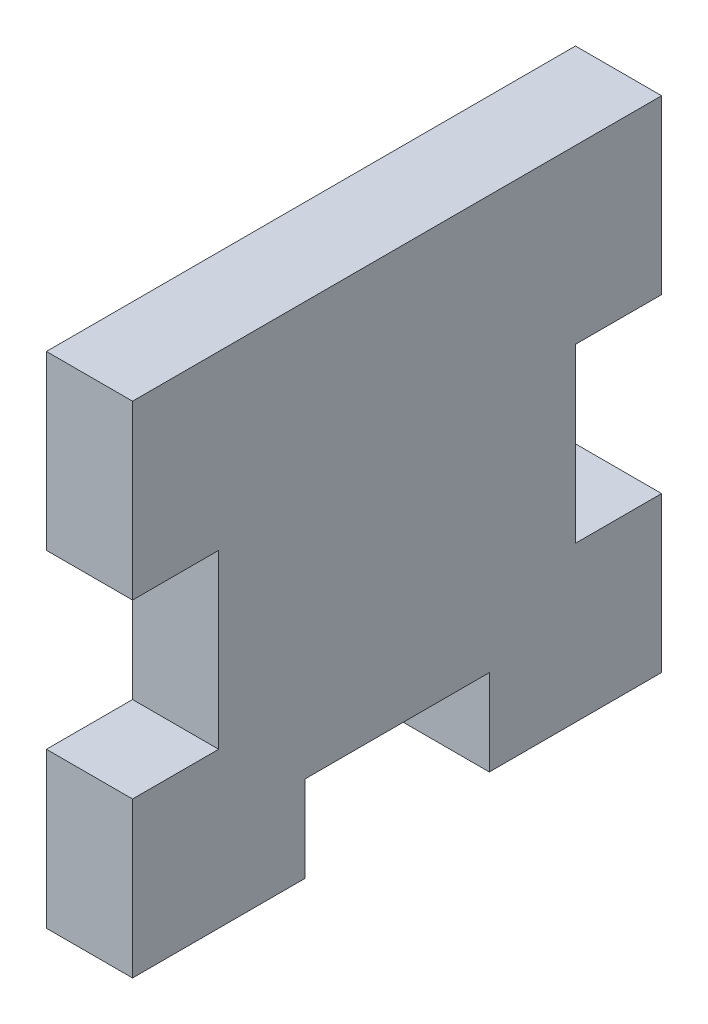
ISO-10303-21;
HEADER;
FILE_DESCRIPTION(('STEP AP214'),'2;1');
FILE_NAME('part.step','',(''),(''),'','','');
FILE_SCHEMA(('AUTOMOTIVE_DESIGN { 1 0 10303 214 1 1 1 1 }'));
ENDSEC;
DATA;
#1=APPLICATION_CONTEXT('core data for automotive mechanical design processes');
#2=APPLICATION_PROTOCOL_DEFINITION('international standard','automotive_design',2000,#1);
#3=PRODUCT_CONTEXT('',#1,'mechanical');
#4=PRODUCT('Part','Part','',(#3));
#5=PRODUCT_RELATED_PRODUCT_CATEGORY('part','',(#4));
#6=PRODUCT_DEFINITION_FORMATION('','',#4);
#7=PRODUCT_DEFINITION_CONTEXT('part definition',#1,'design');
#8=PRODUCT_DEFINITION('design','',#6,#7);
#9=PRODUCT_DEFINITION_SHAPE('','',#8);
#10=(LENGTH_UNIT() NAMED_UNIT(*) SI_UNIT(.MILLI.,.METRE.));
#11=(NAMED_UNIT(*) PLANE_ANGLE_UNIT() SI_UNIT($,.RADIAN.));
#12=(NAMED_UNIT(*) SI_UNIT($,.STERADIAN.) SOLID_ANGLE_UNIT());
#13=UNCERTAINTY_MEASURE_WITH_UNIT(LENGTH_MEASURE(1.E-05),#10,'distance_accuracy_value','');
#14=(GEOMETRIC_REPRESENTATION_CONTEXT(3) GLOBAL_UNCERTAINTY_ASSIGNED_CONTEXT((#13)) GLOBAL_UNIT_ASSIGNED_CONTEXT((#10,
#11,#12)) REPRESENTATION_CONTEXT('',''));
#15=CARTESIAN_POINT('',(0.,0.,0.));
#16=DIRECTION('',(0.,0.,1.));
#17=DIRECTION('',(1.,0.,0.));
#18=AXIS2_PLACEMENT_3D('',#15,#16,#17);
#19=CARTESIAN_POINT('',(0.,5.08,0.));
#20=DIRECTION('',(0.,1.,0.));
#21=DIRECTION('',(0.,0.,1.));
#22=AXIS2_PLACEMENT_3D('',#19,#20,#21);
#23=PLANE('',#22);
#24=DIRECTION('',(0.,0.,-1.));
#25=VECTOR('',#24,1.);
#26=CARTESIAN_POINT('',(-6.35,5.08,0.));
#27=LINE('',#26,#25);
#28=CARTESIAN_POINT('',(-6.34999999999999,5.08,6.35));
#29=VERTEX_POINT('',#28);
#30=CARTESIAN_POINT('',(-6.35,5.08,0.));
#31=VERTEX_POINT('',#30);
#32=EDGE_CURVE('E216',#29,#31,#27,.T.);
#33=ORIENTED_EDGE('',*,*,#32,.F.);
#34=DIRECTION('',(-1.,0.,0.));
#35=VECTOR('',#34,1.);
#36=CARTESIAN_POINT('',(0.,5.08,6.35));
#37=LINE('',#36,#35);
#38=CARTESIAN_POINT('',(0.,5.08,6.35));
#39=VERTEX_POINT('',#38);
#40=EDGE_CURVE('E42',#39,#29,#37,.T.);
#41=ORIENTED_EDGE('',*,*,#40,.F.);
#42=DIRECTION('',(0.,0.,-1.));
#43=VECTOR('',#42,1.);
#44=CARTESIAN_POINT('',(0.,5.08,0.));
#45=LINE('',#44,#43);
#46=CARTESIAN_POINT('',(0.,5.08,0.));
#47=VERTEX_POINT('',#46);
#48=EDGE_CURVE('E168',#39,#47,#45,.T.);
#49=ORIENTED_EDGE('',*,*,#48,.T.);
#50=DIRECTION('',(-1.,0.,0.));
#51=VECTOR('',#50,1.);
#52=CARTESIAN_POINT('',(0.,5.08,0.));
#53=LINE('',#52,#51);
#54=EDGE_CURVE('E11',#47,#31,#53,.T.);
#55=ORIENTED_EDGE('',*,*,#54,.T.);
#56=EDGE_LOOP('',(#33,#41,#49,#55));
#57=FACE_BOUND('',#56,.T.);
#58=ADVANCED_FACE('F32',(#57),#23,.T.);
#59=CARTESIAN_POINT('',(0.,0.,6.35));
#60=DIRECTION('',(0.,0.,1.));
#61=DIRECTION('',(1.,0.,0.));
#62=AXIS2_PLACEMENT_3D('',#59,#60,#61);
#63=PLANE('',#62);
#64=DIRECTION('',(0.,1.,0.));
#65=VECTOR('',#64,1.);
#66=CARTESIAN_POINT('',(-6.34999999999999,0.,6.35));
#67=LINE('',#66,#65);
#68=CARTESIAN_POINT('',(-6.34999999999999,-6.34999999999999,6.35));
#69=VERTEX_POINT('',#68);
#70=EDGE_CURVE('E156',#69,#29,#67,.T.);
#71=ORIENTED_EDGE('',*,*,#70,.F.);
#72=DIRECTION('',(-1.,0.,0.));
#73=VECTOR('',#72,1.);
#74=CARTESIAN_POINT('',(0.,-6.34999999999999,6.35));
#75=LINE('',#74,#73);
#76=CARTESIAN_POINT('',(0.,-6.34999999999999,6.35));
#77=VERTEX_POINT('',#76);
#78=EDGE_CURVE('E152',#77,#69,#75,.T.);
#79=ORIENTED_EDGE('',*,*,#78,.F.);
#80=DIRECTION('',(0.,1.,0.));
#81=VECTOR('',#80,1.);
#82=CARTESIAN_POINT('',(0.,0.,6.35));
#83=LINE('',#82,#81);
#84=EDGE_CURVE('E155',#77,#39,#83,.T.);
#85=ORIENTED_EDGE('',*,*,#84,.T.);
#86=ORIENTED_EDGE('',*,*,#40,.T.);
#87=EDGE_LOOP('',(#71,#79,#85,#86));
#88=FACE_BOUND('',#87,.T.);
#89=ADVANCED_FACE('F154',(#88),#63,.T.);
#90=CARTESIAN_POINT('',(0.,-6.35,0.));
#91=DIRECTION('',(0.,-1.,0.));
#92=DIRECTION('',(0.,0.,-1.));
#93=AXIS2_PLACEMENT_3D('',#90,#91,#92);
#94=PLANE('',#93);
#95=DIRECTION('',(0.,0.,1.));
#96=VECTOR('',#95,1.);
#97=CARTESIAN_POINT('',(-6.35,-6.35,0.));
#98=LINE('',#97,#96);
#99=CARTESIAN_POINT('',(-6.35,-6.35,-6.35));
#100=VERTEX_POINT('',#99);
#101=EDGE_CURVE('E214',#100,#69,#98,.T.);
#102=ORIENTED_EDGE('',*,*,#101,.F.);
#103=DIRECTION('',(-1.,0.,0.));
#104=VECTOR('',#103,1.);
#105=CARTESIAN_POINT('',(0.,-6.35,-6.35));
#106=LINE('',#105,#104);
#107=CARTESIAN_POINT('',(0.,-6.35,-6.35));
#108=VERTEX_POINT('',#107);
#109=EDGE_CURVE('E161',#108,#100,#106,.T.);
#110=ORIENTED_EDGE('',*,*,#109,.F.);
#111=DIRECTION('',(0.,0.,1.));
#112=VECTOR('',#111,1.);
#113=CARTESIAN_POINT('',(0.,-6.35,0.));
#114=LINE('',#113,#112);
#115=EDGE_CURVE('E166',#108,#77,#114,.T.);
#116=ORIENTED_EDGE('',*,*,#115,.T.);
#117=ORIENTED_EDGE('',*,*,#78,.T.);
#118=EDGE_LOOP('',(#102,#110,#116,#117));
#119=FACE_BOUND('',#118,.T.);
#120=ADVANCED_FACE('F171',(#119),#94,.T.);
#121=CARTESIAN_POINT('',(0.,0.,-6.35));
#122=DIRECTION('',(0.,0.,-1.));
#123=DIRECTION('',(0.,1.,0.));
#124=AXIS2_PLACEMENT_3D('',#121,#122,#123);
#125=PLANE('',#124);
#126=DIRECTION('',(0.,-1.,0.));
#127=VECTOR('',#126,1.);
#128=CARTESIAN_POINT('',(-6.35,0.,-6.35));
#129=LINE('',#128,#127);
#130=CARTESIAN_POINT('',(-6.35,0.,-6.35));
#131=VERTEX_POINT('',#130);
#132=EDGE_CURVE('E211',#131,#100,#129,.T.);
#133=ORIENTED_EDGE('',*,*,#132,.F.);
#134=DIRECTION('',(-1.,0.,0.));
#135=VECTOR('',#134,1.);
#136=CARTESIAN_POINT('',(0.,0.,-6.35));
#137=LINE('',#136,#135);
#138=CARTESIAN_POINT('',(0.,0.,-6.35));
#139=VERTEX_POINT('',#138);
#140=EDGE_CURVE('E221',#139,#131,#137,.T.);
#141=ORIENTED_EDGE('',*,*,#140,.F.);
#142=DIRECTION('',(0.,-1.,0.));
#143=VECTOR('',#142,1.);
#144=CARTESIAN_POINT('',(0.,0.,-6.35));
#145=LINE('',#144,#143);
#146=EDGE_CURVE('E172',#139,#108,#145,.T.);
#147=ORIENTED_EDGE('',*,*,#146,.T.);
#148=ORIENTED_EDGE('',*,*,#109,.T.);
#149=EDGE_LOOP('',(#133,#141,#147,#148));
#150=FACE_BOUND('',#149,.T.);
#151=ADVANCED_FACE('F261',(#150),#125,.T.);
#152=CARTESIAN_POINT('',(0.,0.,0.));
#153=DIRECTION('',(0.,-1.,0.));
#154=DIRECTION('',(0.,0.,-1.));
#155=AXIS2_PLACEMENT_3D('',#152,#153,#154);
#156=PLANE('',#155);
#157=DIRECTION('',(0.,0.,1.));
#158=VECTOR('',#157,1.);
#159=CARTESIAN_POINT('',(-6.35,0.,0.));
#160=LINE('',#159,#158);
#161=CARTESIAN_POINT('',(-6.35,0.,-19.9554205404025));
#162=VERTEX_POINT('',#161);
#163=EDGE_CURVE('E208',#162,#131,#160,.T.);
#164=ORIENTED_EDGE('',*,*,#163,.F.);
#165=DIRECTION('',(-1.,0.,0.));
#166=VECTOR('',#165,1.);
#167=CARTESIAN_POINT('',(0.,0.,-19.9554205404025));
#168=LINE('',#167,#166);
#169=CARTESIAN_POINT('',(0.,0.,-19.9554205404025));
#170=VERTEX_POINT('',#169);
#171=EDGE_CURVE('E223',#170,#162,#168,.T.);
#172=ORIENTED_EDGE('',*,*,#171,.F.);
#173=DIRECTION('',(0.,0.,1.));
#174=VECTOR('',#173,1.);
#175=CARTESIAN_POINT('',(0.,0.,0.));
#176=LINE('',#175,#174);
#177=EDGE_CURVE('E174',#170,#139,#176,.T.);
#178=ORIENTED_EDGE('',*,*,#177,.T.);
#179=ORIENTED_EDGE('',*,*,#140,.T.);
#180=EDGE_LOOP('',(#164,#172,#178,#179));
#181=FACE_BOUND('',#180,.T.);
#182=ADVANCED_FACE('F264',(#181),#156,.T.);
#183=CARTESIAN_POINT('',(0.,0.,-19.9554205404025));
#184=DIRECTION('',(0.,0.,-1.));
#185=DIRECTION('',(-1.,0.,0.));
#186=AXIS2_PLACEMENT_3D('',#183,#184,#185);
#187=PLANE('',#186);
#188=DIRECTION('',(0.,-1.,0.));
#189=VECTOR('',#188,1.);
#190=CARTESIAN_POINT('',(-6.35,0.,-19.9554205404025));
#191=LINE('',#190,#189);
#192=CARTESIAN_POINT('',(-6.35,-6.35,-19.9554205404025));
#193=VERTEX_POINT('',#192);
#194=EDGE_CURVE('E205',#162,#193,#191,.T.);
#195=ORIENTED_EDGE('',*,*,#194,.T.);
#196=DIRECTION('',(-1.,0.,0.));
#197=VECTOR('',#196,1.);
#198=CARTESIAN_POINT('',(0.,-6.35,-19.9554205404025));
#199=LINE('',#198,#197);
#200=CARTESIAN_POINT('',(0.,-6.35,-19.9554205404025));
#201=VERTEX_POINT('',#200);
#202=EDGE_CURVE('E225',#201,#193,#199,.T.);
#203=ORIENTED_EDGE('',*,*,#202,.F.);
#204=DIRECTION('',(0.,-1.,0.));
#205=VECTOR('',#204,1.);
#206=CARTESIAN_POINT('',(0.,0.,-19.9554205404025));
#207=LINE('',#206,#205);
#208=EDGE_CURVE('E339',#170,#201,#207,.T.);
#209=ORIENTED_EDGE('',*,*,#208,.F.);
#210=ORIENTED_EDGE('',*,*,#171,.T.);
#211=EDGE_LOOP('',(#195,#203,#209,#210));
#212=FACE_BOUND('',#211,.T.);
#213=ADVANCED_FACE('F268',(#212),#187,.F.);
#214=CARTESIAN_POINT('',(0.,-6.35,0.));
#215=DIRECTION('',(0.,-1.,0.));
#216=DIRECTION('',(0.,0.,-1.));
#217=AXIS2_PLACEMENT_3D('',#214,#215,#216);
#218=PLANE('',#217);
#219=DIRECTION('',(0.,0.,1.));
#220=VECTOR('',#219,1.);
#221=CARTESIAN_POINT('',(-6.35,-6.35,0.));
#222=LINE('',#221,#220);
#223=CARTESIAN_POINT('',(-6.35,-6.35,-32.6554205404025));
#224=VERTEX_POINT('',#223);
#225=EDGE_CURVE('E202',#224,#193,#222,.T.);
#226=ORIENTED_EDGE('',*,*,#225,.F.);
#227=DIRECTION('',(-1.,0.,0.));
#228=VECTOR('',#227,1.);
#229=CARTESIAN_POINT('',(0.,-6.35,-32.6554205404025));
#230=LINE('',#229,#228);
#231=CARTESIAN_POINT('',(0.,-6.35,-32.6554205404025));
#232=VERTEX_POINT('',#231);
#233=EDGE_CURVE('E227',#232,#224,#230,.T.);
#234=ORIENTED_EDGE('',*,*,#233,.F.);
#235=DIRECTION('',(0.,0.,1.));
#236=VECTOR('',#235,1.);
#237=CARTESIAN_POINT('',(0.,-6.35,0.));
#238=LINE('',#237,#236);
#239=EDGE_CURVE('E337',#232,#201,#238,.T.);
#240=ORIENTED_EDGE('',*,*,#239,.T.);
#241=ORIENTED_EDGE('',*,*,#202,.T.);
#242=EDGE_LOOP('',(#226,#234,#240,#241));
#243=FACE_BOUND('',#242,.T.);
#244=ADVANCED_FACE('F272',(#243),#218,.T.);
#245=CARTESIAN_POINT('',(0.,0.,-32.6554205404025));
#246=DIRECTION('',(0.,0.,-1.));
#247=DIRECTION('',(-1.,0.,0.));
#248=AXIS2_PLACEMENT_3D('',#245,#246,#247);
#249=PLANE('',#248);
#250=DIRECTION('',(0.,-1.,0.));
#251=VECTOR('',#250,1.);
#252=CARTESIAN_POINT('',(-6.35,0.,-32.6554205404025));
#253=LINE('',#252,#251);
#254=CARTESIAN_POINT('',(-6.35,5.08,-32.6554205404025));
#255=VERTEX_POINT('',#254);
#256=EDGE_CURVE('E193',#255,#224,#253,.T.);
#257=ORIENTED_EDGE('',*,*,#256,.F.);
#258=DIRECTION('',(-1.,0.,0.));
#259=VECTOR('',#258,1.);
#260=CARTESIAN_POINT('',(0.,5.08,-32.6554205404025));
#261=LINE('',#260,#259);
#262=CARTESIAN_POINT('',(0.,5.08,-32.6554205404025));
#263=VERTEX_POINT('',#262);
#264=EDGE_CURVE('E229',#263,#255,#261,.T.);
#265=ORIENTED_EDGE('',*,*,#264,.F.);
#266=DIRECTION('',(0.,-1.,0.));
#267=VECTOR('',#266,1.);
#268=CARTESIAN_POINT('',(0.,0.,-32.6554205404025));
#269=LINE('',#268,#267);
#270=EDGE_CURVE('E330',#263,#232,#269,.T.);
#271=ORIENTED_EDGE('',*,*,#270,.T.);
#272=ORIENTED_EDGE('',*,*,#233,.T.);
#273=EDGE_LOOP('',(#257,#265,#271,#272));
#274=FACE_BOUND('',#273,.T.);
#275=ADVANCED_FACE('F276',(#274),#249,.T.);
#276=CARTESIAN_POINT('',(0.,5.08,0.));
#277=DIRECTION('',(0.,-1.,0.));
#278=DIRECTION('',(0.,0.,-1.));
#279=AXIS2_PLACEMENT_3D('',#276,#277,#278);
#280=PLANE('',#279);
#281=DIRECTION('',(0.,0.,1.));
#282=VECTOR('',#281,1.);
#283=CARTESIAN_POINT('',(-6.35,5.08,0.));
#284=LINE('',#283,#282);
#285=CARTESIAN_POINT('',(-6.35,5.08,-26.3054205404025));
#286=VERTEX_POINT('',#285);
#287=EDGE_CURVE('E199',#255,#286,#284,.T.);
#288=ORIENTED_EDGE('',*,*,#287,.T.);
#289=DIRECTION('',(-1.,0.,0.));
#290=VECTOR('',#289,1.);
#291=CARTESIAN_POINT('',(0.,5.08,-26.3054205404025));
#292=LINE('',#291,#290);
#293=CARTESIAN_POINT('',(0.,5.08,-26.3054205404025));
#294=VERTEX_POINT('',#293);
#295=EDGE_CURVE('E231',#294,#286,#292,.T.);
#296=ORIENTED_EDGE('',*,*,#295,.F.);
#297=DIRECTION('',(0.,0.,1.));
#298=VECTOR('',#297,1.);
#299=CARTESIAN_POINT('',(0.,5.08,0.));
#300=LINE('',#299,#298);
#301=EDGE_CURVE('E327',#263,#294,#300,.T.);
#302=ORIENTED_EDGE('',*,*,#301,.F.);
#303=ORIENTED_EDGE('',*,*,#264,.T.);
#304=EDGE_LOOP('',(#288,#296,#302,#303));
#305=FACE_BOUND('',#304,.T.);
#306=ADVANCED_FACE('F280',(#305),#280,.F.);
#307=CARTESIAN_POINT('',(0.,0.,-26.3054205404025));
#308=DIRECTION('',(0.,0.,-1.));
#309=DIRECTION('',(0.,1.,0.));
#310=AXIS2_PLACEMENT_3D('',#307,#308,#309);
#311=PLANE('',#310);
#312=DIRECTION('',(0.,-1.,0.));
#313=VECTOR('',#312,1.);
#314=CARTESIAN_POINT('',(-6.35,0.,-26.3054205404025));
#315=LINE('',#314,#313);
#316=CARTESIAN_POINT('',(-6.35,17.78,-26.3054205404025));
#317=VERTEX_POINT('',#316);
#318=EDGE_CURVE('E196',#317,#286,#315,.T.);
#319=ORIENTED_EDGE('',*,*,#318,.F.);
#320=DIRECTION('',(-1.,0.,0.));
#321=VECTOR('',#320,1.);
#322=CARTESIAN_POINT('',(0.,17.78,-26.3054205404025));
#323=LINE('',#322,#321);
#324=CARTESIAN_POINT('',(0.,17.78,-26.3054205404025));
#325=VERTEX_POINT('',#324);
#326=EDGE_CURVE('E233',#325,#317,#323,.T.);
#327=ORIENTED_EDGE('',*,*,#326,.F.);
#328=DIRECTION('',(0.,-1.,0.));
#329=VECTOR('',#328,1.);
#330=CARTESIAN_POINT('',(0.,0.,-26.3054205404025));
#331=LINE('',#330,#329);
#332=EDGE_CURVE('E325',#325,#294,#331,.T.);
#333=ORIENTED_EDGE('',*,*,#332,.T.);
#334=ORIENTED_EDGE('',*,*,#295,.T.);
#335=EDGE_LOOP('',(#319,#327,#333,#334));
#336=FACE_BOUND('',#335,.T.);
#337=ADVANCED_FACE('F285',(#336),#311,.T.);
#338=CARTESIAN_POINT('',(0.,17.78,0.));
#339=DIRECTION('',(0.,-1.,0.));
#340=DIRECTION('',(0.,0.,-1.));
#341=AXIS2_PLACEMENT_3D('',#338,#339,#340);
#342=PLANE('',#341);
#343=DIRECTION('',(0.,0.,1.));
#344=VECTOR('',#343,1.);
#345=CARTESIAN_POINT('',(-6.35,17.78,0.));
#346=LINE('',#345,#344);
#347=CARTESIAN_POINT('',(-6.35,17.78,-32.6554205404025));
#348=VERTEX_POINT('',#347);
#349=EDGE_CURVE('E192',#348,#317,#346,.T.);
#350=ORIENTED_EDGE('',*,*,#349,.F.);
#351=DIRECTION('',(-1.,0.,0.));
#352=VECTOR('',#351,1.);
#353=CARTESIAN_POINT('',(0.,17.78,-32.6554205404025));
#354=LINE('',#353,#352);
#355=CARTESIAN_POINT('',(0.,17.78,-32.6554205404025));
#356=VERTEX_POINT('',#355);
#357=EDGE_CURVE('E235',#356,#348,#354,.T.);
#358=ORIENTED_EDGE('',*,*,#357,.F.);
#359=DIRECTION('',(0.,0.,1.));
#360=VECTOR('',#359,1.);
#361=CARTESIAN_POINT('',(0.,17.78,0.));
#362=LINE('',#361,#360);
#363=EDGE_CURVE('E348',#356,#325,#362,.T.);
#364=ORIENTED_EDGE('',*,*,#363,.T.);
#365=ORIENTED_EDGE('',*,*,#326,.T.);
#366=EDGE_LOOP('',(#350,#358,#364,#365));
#367=FACE_BOUND('',#366,.T.);
#368=ADVANCED_FACE('F289',(#367),#342,.T.);
#369=CARTESIAN_POINT('',(-6.35,30.48,-32.6554205404025));
#370=VERTEX_POINT('',#369);
#371=EDGE_CURVE('E189',#370,#348,#253,.T.);
#372=ORIENTED_EDGE('',*,*,#371,.F.);
#373=DIRECTION('',(-1.,0.,0.));
#374=VECTOR('',#373,1.);
#375=CARTESIAN_POINT('',(0.,30.48,-32.6554205404025));
#376=LINE('',#375,#374);
#377=CARTESIAN_POINT('',(0.,30.48,-32.6554205404025));
#378=VERTEX_POINT('',#377);
#379=EDGE_CURVE('E237',#378,#370,#376,.T.);
#380=ORIENTED_EDGE('',*,*,#379,.F.);
#381=EDGE_CURVE('E315',#378,#356,#269,.T.);
#382=ORIENTED_EDGE('',*,*,#381,.T.);
#383=ORIENTED_EDGE('',*,*,#357,.T.);
#384=EDGE_LOOP('',(#372,#380,#382,#383));
#385=FACE_BOUND('',#384,.T.);
#386=ADVANCED_FACE('F282',(#385),#249,.T.);
#387=CARTESIAN_POINT('',(0.,30.48,0.));
#388=DIRECTION('',(0.,-1.,0.));
#389=DIRECTION('',(0.,0.,-1.));
#390=AXIS2_PLACEMENT_3D('',#387,#388,#389);
#391=PLANE('',#390);
#392=DIRECTION('',(0.,0.,1.));
#393=VECTOR('',#392,1.);
#394=CARTESIAN_POINT('',(-6.35,30.48,0.));
#395=LINE('',#394,#393);
#396=CARTESIAN_POINT('',(-6.34999999999999,30.48,6.35));
#397=VERTEX_POINT('',#396);
#398=EDGE_CURVE('E186',#370,#397,#395,.T.);
#399=ORIENTED_EDGE('',*,*,#398,.T.);
#400=DIRECTION('',(-1.,0.,0.));
#401=VECTOR('',#400,1.);
#402=CARTESIAN_POINT('',(0.,30.48,6.35));
#403=LINE('',#402,#401);
#404=CARTESIAN_POINT('',(0.,30.48,6.35));
#405=VERTEX_POINT('',#404);
#406=EDGE_CURVE('E239',#405,#397,#403,.T.);
#407=ORIENTED_EDGE('',*,*,#406,.F.);
#408=DIRECTION('',(0.,0.,1.));
#409=VECTOR('',#408,1.);
#410=CARTESIAN_POINT('',(0.,30.48,0.));
#411=LINE('',#410,#409);
#412=EDGE_CURVE('E351',#378,#405,#411,.T.);
#413=ORIENTED_EDGE('',*,*,#412,.F.);
#414=ORIENTED_EDGE('',*,*,#379,.T.);
#415=EDGE_LOOP('',(#399,#407,#413,#414));
#416=FACE_BOUND('',#415,.T.);
#417=ADVANCED_FACE('F294',(#416),#391,.F.);
#418=CARTESIAN_POINT('',(-6.34999999999999,17.78,6.35));
#419=VERTEX_POINT('',#418);
#420=EDGE_CURVE('E183',#419,#397,#67,.T.);
#421=ORIENTED_EDGE('',*,*,#420,.F.);
#422=DIRECTION('',(-1.,0.,0.));
#423=VECTOR('',#422,1.);
#424=CARTESIAN_POINT('',(0.,17.78,6.35));
#425=LINE('',#424,#423);
#426=CARTESIAN_POINT('',(0.,17.78,6.35));
#427=VERTEX_POINT('',#426);
#428=EDGE_CURVE('E240',#427,#419,#425,.T.);
#429=ORIENTED_EDGE('',*,*,#428,.F.);
#430=EDGE_CURVE('E170',#427,#405,#83,.T.);
#431=ORIENTED_EDGE('',*,*,#430,.T.);
#432=ORIENTED_EDGE('',*,*,#406,.T.);
#433=EDGE_LOOP('',(#421,#429,#431,#432));
#434=FACE_BOUND('',#433,.T.);
#435=ADVANCED_FACE('F255',(#434),#63,.T.);
#436=CARTESIAN_POINT('',(0.,17.78,0.));
#437=DIRECTION('',(0.,1.,0.));
#438=DIRECTION('',(0.,0.,1.));
#439=AXIS2_PLACEMENT_3D('',#436,#437,#438);
#440=PLANE('',#439);
#441=DIRECTION('',(0.,0.,-1.));
#442=VECTOR('',#441,1.);
#443=CARTESIAN_POINT('',(-6.35,17.78,0.));
#444=LINE('',#443,#442);
#445=CARTESIAN_POINT('',(-6.35,17.78,0.));
#446=VERTEX_POINT('',#445);
#447=EDGE_CURVE('E181',#419,#446,#444,.T.);
#448=ORIENTED_EDGE('',*,*,#447,.T.);
#449=DIRECTION('',(-1.,0.,0.));
#450=VECTOR('',#449,1.);
#451=CARTESIAN_POINT('',(0.,17.78,0.));
#452=LINE('',#451,#450);
#453=CARTESIAN_POINT('',(0.,17.78,0.));
#454=VERTEX_POINT('',#453);
#455=EDGE_CURVE('E36',#454,#446,#452,.T.);
#456=ORIENTED_EDGE('',*,*,#455,.F.);
#457=DIRECTION('',(0.,0.,-1.));
#458=VECTOR('',#457,1.);
#459=CARTESIAN_POINT('',(0.,17.78,0.));
#460=LINE('',#459,#458);
#461=EDGE_CURVE('E114',#427,#454,#460,.T.);
#462=ORIENTED_EDGE('',*,*,#461,.F.);
#463=ORIENTED_EDGE('',*,*,#428,.T.);
#464=EDGE_LOOP('',(#448,#456,#462,#463));
#465=FACE_BOUND('',#464,.T.);
#466=ADVANCED_FACE('F297',(#465),#440,.F.);
#467=CARTESIAN_POINT('',(0.,0.,0.));
#468=DIRECTION('',(0.,0.,-1.));
#469=DIRECTION('',(-1.,0.,0.));
#470=AXIS2_PLACEMENT_3D('',#467,#468,#469);
#471=PLANE('',#470);
#472=DIRECTION('',(0.,-1.,0.));
#473=VECTOR('',#472,1.);
#474=CARTESIAN_POINT('',(-6.35,0.,0.));
#475=LINE('',#474,#473);
#476=EDGE_CURVE('E179',#446,#31,#475,.T.);
#477=ORIENTED_EDGE('',*,*,#476,.T.);
#478=ORIENTED_EDGE('',*,*,#54,.F.);
#479=DIRECTION('',(0.,-1.,0.));
#480=VECTOR('',#479,1.);
#481=CARTESIAN_POINT('',(0.,0.,0.));
#482=LINE('',#481,#480);
#483=EDGE_CURVE('E51',#454,#47,#482,.T.);
#484=ORIENTED_EDGE('',*,*,#483,.F.);
#485=ORIENTED_EDGE('',*,*,#455,.T.);
#486=EDGE_LOOP('',(#477,#478,#484,#485));
#487=FACE_BOUND('',#486,.T.);
#488=ADVANCED_FACE('F34',(#487),#471,.F.);
#489=CARTESIAN_POINT('',(-6.35,0.,0.));
#490=DIRECTION('',(-1.,0.,0.));
#491=DIRECTION('',(0.,0.,1.));
#492=AXIS2_PLACEMENT_3D('',#489,#490,#491);
#493=PLANE('',#492);
#494=ORIENTED_EDGE('',*,*,#476,.F.);
#495=ORIENTED_EDGE('',*,*,#447,.F.);
#496=ORIENTED_EDGE('',*,*,#420,.T.);
#497=ORIENTED_EDGE('',*,*,#398,.F.);
#498=ORIENTED_EDGE('',*,*,#371,.T.);
#499=ORIENTED_EDGE('',*,*,#349,.T.);
#500=ORIENTED_EDGE('',*,*,#318,.T.);
#501=ORIENTED_EDGE('',*,*,#287,.F.);
#502=ORIENTED_EDGE('',*,*,#256,.T.);
#503=ORIENTED_EDGE('',*,*,#225,.T.);
#504=ORIENTED_EDGE('',*,*,#194,.F.);
#505=ORIENTED_EDGE('',*,*,#163,.T.);
#506=ORIENTED_EDGE('',*,*,#132,.T.);
#507=ORIENTED_EDGE('',*,*,#101,.T.);
#508=ORIENTED_EDGE('',*,*,#70,.T.);
#509=ORIENTED_EDGE('',*,*,#32,.T.);
#510=EDGE_LOOP('',(#494,#495,#496,#497,#498,#499,#500,#501,#502,#503,#504,#505,#506,#507,#508,#509));
#511=FACE_BOUND('',#510,.T.);
#512=ADVANCED_FACE('F247',(#511),#493,.T.);
#513=CARTESIAN_POINT('',(0.,0.,0.));
#514=DIRECTION('',(-1.,0.,0.));
#515=DIRECTION('',(0.,0.,1.));
#516=AXIS2_PLACEMENT_3D('',#513,#514,#515);
#517=PLANE('',#516);
#518=ORIENTED_EDGE('',*,*,#483,.T.);
#519=ORIENTED_EDGE('',*,*,#48,.F.);
#520=ORIENTED_EDGE('',*,*,#84,.F.);
#521=ORIENTED_EDGE('',*,*,#115,.F.);
#522=ORIENTED_EDGE('',*,*,#146,.F.);
#523=ORIENTED_EDGE('',*,*,#177,.F.);
#524=ORIENTED_EDGE('',*,*,#208,.T.);
#525=ORIENTED_EDGE('',*,*,#239,.F.);
#526=ORIENTED_EDGE('',*,*,#270,.F.);
#527=ORIENTED_EDGE('',*,*,#301,.T.);
#528=ORIENTED_EDGE('',*,*,#332,.F.);
#529=ORIENTED_EDGE('',*,*,#363,.F.);
#530=ORIENTED_EDGE('',*,*,#381,.F.);
#531=ORIENTED_EDGE('',*,*,#412,.T.);
#532=ORIENTED_EDGE('',*,*,#430,.F.);
#533=ORIENTED_EDGE('',*,*,#461,.T.);
#534=EDGE_LOOP('',(#518,#519,#520,#521,#522,#523,#524,#525,#526,#527,#528,#529,#530,#531,#532,#533));
#535=FACE_BOUND('',#534,.T.);
#536=ADVANCED_FACE('F164',(#535),#517,.F.);
#537=CLOSED_SHELL('',(#58,#89,#120,#151,#182,#213,#244,#275,#306,#337,#368,#386,#417,#435,#466,
#488,#512,#536));
#538=MANIFOLD_SOLID_BREP('B2',#537);
#539=ADVANCED_BREP_SHAPE_REPRESENTATION('',(#18,#538),#14);
#540=SHAPE_DEFINITION_REPRESENTATION(#9,#539);
ENDSEC;
END-ISO-10303-21;
